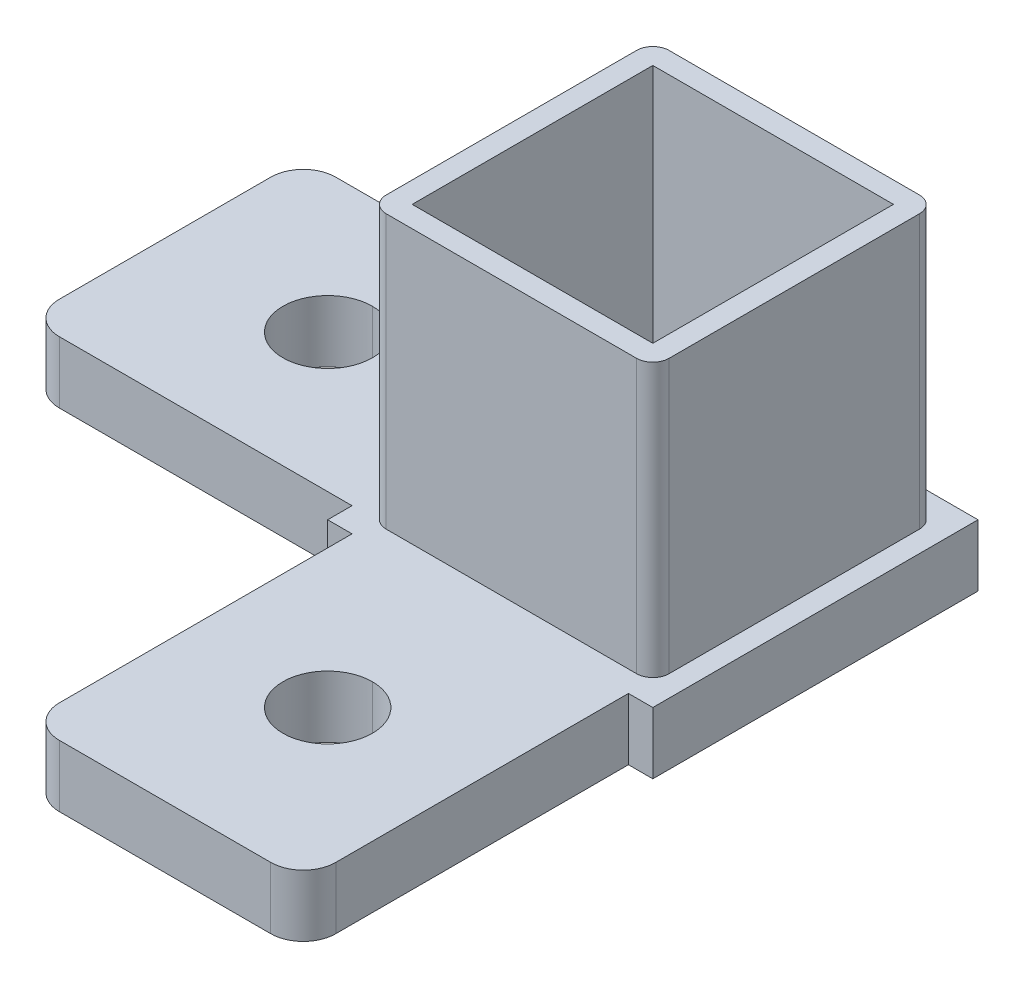
ISO-10303-21;
HEADER;
FILE_DESCRIPTION(('STEP AP214'),'2;1');
FILE_NAME('part.step','',(''),(''),'','','');
FILE_SCHEMA(('AUTOMOTIVE_DESIGN { 1 0 10303 214 1 1 1 1 }'));
ENDSEC;
DATA;
#1=APPLICATION_CONTEXT('core data for automotive mechanical design processes');
#2=APPLICATION_PROTOCOL_DEFINITION('international standard','automotive_design',2000,#1);
#3=PRODUCT_CONTEXT('',#1,'mechanical');
#4=PRODUCT('Part','Part','',(#3));
#5=PRODUCT_RELATED_PRODUCT_CATEGORY('part','',(#4));
#6=PRODUCT_DEFINITION_FORMATION('','',#4);
#7=PRODUCT_DEFINITION_CONTEXT('part definition',#1,'design');
#8=PRODUCT_DEFINITION('design','',#6,#7);
#9=PRODUCT_DEFINITION_SHAPE('','',#8);
#10=(LENGTH_UNIT() NAMED_UNIT(*) SI_UNIT(.MILLI.,.METRE.));
#11=(NAMED_UNIT(*) PLANE_ANGLE_UNIT() SI_UNIT($,.RADIAN.));
#12=(NAMED_UNIT(*) SI_UNIT($,.STERADIAN.) SOLID_ANGLE_UNIT());
#13=UNCERTAINTY_MEASURE_WITH_UNIT(LENGTH_MEASURE(1.E-05),#10,'distance_accuracy_value','');
#14=(GEOMETRIC_REPRESENTATION_CONTEXT(3) GLOBAL_UNCERTAINTY_ASSIGNED_CONTEXT((#13)) GLOBAL_UNIT_ASSIGNED_CONTEXT((#10,
#11,#12)) REPRESENTATION_CONTEXT('',''));
#15=CARTESIAN_POINT('',(0.,0.,0.));
#16=DIRECTION('',(0.,0.,1.));
#17=DIRECTION('',(1.,0.,0.));
#18=AXIS2_PLACEMENT_3D('',#15,#16,#17);
#19=CARTESIAN_POINT('',(-38.1,4.826,-8.255));
#20=DIRECTION('',(1.,0.,0.));
#21=DIRECTION('',(0.,0.,-1.));
#22=AXIS2_PLACEMENT_3D('',#19,#20,#21);
#23=PLANE('',#22);
#24=DIRECTION('',(0.,0.,1.));
#25=VECTOR('',#24,1.);
#26=CARTESIAN_POINT('',(-38.1,0.,-8.255));
#27=LINE('',#26,#25);
#28=CARTESIAN_POINT('',(-38.1,0.,-8.255));
#29=VERTEX_POINT('',#28);
#30=CARTESIAN_POINT('',(-38.1,0.,8.255));
#31=VERTEX_POINT('',#30);
#32=EDGE_CURVE('E11',#29,#31,#27,.T.);
#33=ORIENTED_EDGE('',*,*,#32,.T.);
#34=DIRECTION('',(0.,-1.,0.));
#35=VECTOR('',#34,1.);
#36=CARTESIAN_POINT('',(-38.1,4.826,8.255));
#37=LINE('',#36,#35);
#38=CARTESIAN_POINT('',(-38.1,4.826,8.255));
#39=VERTEX_POINT('',#38);
#40=EDGE_CURVE('E25',#39,#31,#37,.T.);
#41=ORIENTED_EDGE('',*,*,#40,.F.);
#42=DIRECTION('',(0.,0.,1.));
#43=VECTOR('',#42,1.);
#44=CARTESIAN_POINT('',(-38.1,4.826,-8.255));
#45=LINE('',#44,#43);
#46=CARTESIAN_POINT('',(-38.1,4.826,-8.255));
#47=VERTEX_POINT('',#46);
#48=EDGE_CURVE('E666',#47,#39,#45,.T.);
#49=ORIENTED_EDGE('',*,*,#48,.F.);
#50=DIRECTION('',(0.,-1.,0.));
#51=VECTOR('',#50,1.);
#52=CARTESIAN_POINT('',(-38.1,4.826,-8.255));
#53=LINE('',#52,#51);
#54=EDGE_CURVE('E662',#47,#29,#53,.T.);
#55=ORIENTED_EDGE('',*,*,#54,.T.);
#56=EDGE_LOOP('',(#33,#41,#49,#55));
#57=FACE_BOUND('',#56,.T.);
#58=ADVANCED_FACE('F17',(#57),#23,.F.);
#59=CARTESIAN_POINT('',(-35.5600000000018,4.826,-8.25500000000177));
#60=DIRECTION('',(0.,-1.,0.));
#61=DIRECTION('',(0.707106781186551,0.,0.707106781186544));
#62=AXIS2_PLACEMENT_3D('',#59,#60,#61);
#63=CYLINDRICAL_SURFACE('',#62,2.53999999999824);
#64=CARTESIAN_POINT('',(-35.5600000000018,0.,-8.25500000000177));
#65=DIRECTION('',(0.,1.,0.));
#66=DIRECTION('',(1.,0.,0.));
#67=AXIS2_PLACEMENT_3D('',#64,#65,#66);
#68=CIRCLE('',#67,2.53999999999824);
#69=CARTESIAN_POINT('',(-35.56,0.,-10.795));
#70=VERTEX_POINT('',#69);
#71=EDGE_CURVE('E657',#70,#29,#68,.T.);
#72=ORIENTED_EDGE('',*,*,#71,.T.);
#73=ORIENTED_EDGE('',*,*,#54,.F.);
#74=CARTESIAN_POINT('',(-35.5600000000018,4.826,-8.25500000000177));
#75=DIRECTION('',(0.,1.,0.));
#76=DIRECTION('',(1.,0.,0.));
#77=AXIS2_PLACEMENT_3D('',#74,#75,#76);
#78=CIRCLE('',#77,2.53999999999824);
#79=CARTESIAN_POINT('',(-35.56,4.826,-10.795));
#80=VERTEX_POINT('',#79);
#81=EDGE_CURVE('E652',#80,#47,#78,.T.);
#82=ORIENTED_EDGE('',*,*,#81,.F.);
#83=DIRECTION('',(0.,-1.,0.));
#84=VECTOR('',#83,1.);
#85=CARTESIAN_POINT('',(-35.56,4.826,-10.795));
#86=LINE('',#85,#84);
#87=EDGE_CURVE('E648',#80,#70,#86,.T.);
#88=ORIENTED_EDGE('',*,*,#87,.T.);
#89=EDGE_LOOP('',(#72,#73,#82,#88));
#90=FACE_BOUND('',#89,.T.);
#91=ADVANCED_FACE('F684',(#90),#63,.T.);
#92=CARTESIAN_POINT('',(-12.7,4.826,-10.795));
#93=DIRECTION('',(0.,0.,1.));
#94=DIRECTION('',(1.,0.,0.));
#95=AXIS2_PLACEMENT_3D('',#92,#93,#94);
#96=PLANE('',#95);
#97=DIRECTION('',(-1.,0.,0.));
#98=VECTOR('',#97,1.);
#99=CARTESIAN_POINT('',(-12.7,0.,-10.795));
#100=LINE('',#99,#98);
#101=CARTESIAN_POINT('',(-12.7,0.,-10.795));
#102=VERTEX_POINT('',#101);
#103=EDGE_CURVE('E643',#102,#70,#100,.T.);
#104=ORIENTED_EDGE('',*,*,#103,.T.);
#105=ORIENTED_EDGE('',*,*,#87,.F.);
#106=DIRECTION('',(-1.,0.,0.));
#107=VECTOR('',#106,1.);
#108=CARTESIAN_POINT('',(-12.7,4.826,-10.795));
#109=LINE('',#108,#107);
#110=CARTESIAN_POINT('',(-12.7,4.826,-10.795));
#111=VERTEX_POINT('',#110);
#112=EDGE_CURVE('E638',#111,#80,#109,.T.);
#113=ORIENTED_EDGE('',*,*,#112,.F.);
#114=DIRECTION('',(0.,-1.,0.));
#115=VECTOR('',#114,1.);
#116=CARTESIAN_POINT('',(-12.7,4.826,-10.795));
#117=LINE('',#116,#115);
#118=EDGE_CURVE('E634',#111,#102,#117,.T.);
#119=ORIENTED_EDGE('',*,*,#118,.T.);
#120=EDGE_LOOP('',(#104,#105,#113,#119));
#121=FACE_BOUND('',#120,.T.);
#122=ADVANCED_FACE('F737',(#121),#96,.F.);
#123=CARTESIAN_POINT('',(-12.7,4.826,-12.7));
#124=DIRECTION('',(1.,0.,0.));
#125=DIRECTION('',(0.,0.,-1.));
#126=AXIS2_PLACEMENT_3D('',#123,#124,#125);
#127=PLANE('',#126);
#128=DIRECTION('',(0.,0.,1.));
#129=VECTOR('',#128,1.);
#130=CARTESIAN_POINT('',(-12.7,0.,-12.7));
#131=LINE('',#130,#129);
#132=CARTESIAN_POINT('',(-12.7,0.,-12.7));
#133=VERTEX_POINT('',#132);
#134=EDGE_CURVE('E629',#133,#102,#131,.T.);
#135=ORIENTED_EDGE('',*,*,#134,.T.);
#136=ORIENTED_EDGE('',*,*,#118,.F.);
#137=DIRECTION('',(0.,0.,1.));
#138=VECTOR('',#137,1.);
#139=CARTESIAN_POINT('',(-12.7,4.826,-12.7));
#140=LINE('',#139,#138);
#141=CARTESIAN_POINT('',(-12.7,4.826,-12.7));
#142=VERTEX_POINT('',#141);
#143=EDGE_CURVE('E624',#142,#111,#140,.T.);
#144=ORIENTED_EDGE('',*,*,#143,.F.);
#145=DIRECTION('',(0.,-1.,0.));
#146=VECTOR('',#145,1.);
#147=CARTESIAN_POINT('',(-12.7,4.826,-12.7));
#148=LINE('',#147,#146);
#149=EDGE_CURVE('E620',#142,#133,#148,.T.);
#150=ORIENTED_EDGE('',*,*,#149,.T.);
#151=EDGE_LOOP('',(#135,#136,#144,#150));
#152=FACE_BOUND('',#151,.T.);
#153=ADVANCED_FACE('F734',(#152),#127,.F.);
#154=CARTESIAN_POINT('',(12.7,4.826,-12.7));
#155=DIRECTION('',(0.,0.,1.));
#156=DIRECTION('',(1.,0.,0.));
#157=AXIS2_PLACEMENT_3D('',#154,#155,#156);
#158=PLANE('',#157);
#159=DIRECTION('',(-1.,0.,0.));
#160=VECTOR('',#159,1.);
#161=CARTESIAN_POINT('',(12.7,0.,-12.7));
#162=LINE('',#161,#160);
#163=CARTESIAN_POINT('',(12.7,0.,-12.7));
#164=VERTEX_POINT('',#163);
#165=EDGE_CURVE('E615',#164,#133,#162,.T.);
#166=ORIENTED_EDGE('',*,*,#165,.T.);
#167=ORIENTED_EDGE('',*,*,#149,.F.);
#168=DIRECTION('',(-1.,0.,0.));
#169=VECTOR('',#168,1.);
#170=CARTESIAN_POINT('',(12.7,4.826,-12.7));
#171=LINE('',#170,#169);
#172=CARTESIAN_POINT('',(12.7,4.826,-12.7));
#173=VERTEX_POINT('',#172);
#174=EDGE_CURVE('E610',#173,#142,#171,.T.);
#175=ORIENTED_EDGE('',*,*,#174,.F.);
#176=DIRECTION('',(0.,-1.,0.));
#177=VECTOR('',#176,1.);
#178=CARTESIAN_POINT('',(12.7,4.826,-12.7));
#179=LINE('',#178,#177);
#180=EDGE_CURVE('E606',#173,#164,#179,.T.);
#181=ORIENTED_EDGE('',*,*,#180,.T.);
#182=EDGE_LOOP('',(#166,#167,#175,#181));
#183=FACE_BOUND('',#182,.T.);
#184=ADVANCED_FACE('F731',(#183),#158,.F.);
#185=CARTESIAN_POINT('',(12.7,4.826,12.7));
#186=DIRECTION('',(-1.,0.,0.));
#187=DIRECTION('',(0.,0.,1.));
#188=AXIS2_PLACEMENT_3D('',#185,#186,#187);
#189=PLANE('',#188);
#190=DIRECTION('',(0.,0.,-1.));
#191=VECTOR('',#190,1.);
#192=CARTESIAN_POINT('',(12.7,0.,12.7));
#193=LINE('',#192,#191);
#194=CARTESIAN_POINT('',(12.7,0.,12.7));
#195=VERTEX_POINT('',#194);
#196=EDGE_CURVE('E601',#195,#164,#193,.T.);
#197=ORIENTED_EDGE('',*,*,#196,.T.);
#198=ORIENTED_EDGE('',*,*,#180,.F.);
#199=DIRECTION('',(0.,0.,-1.));
#200=VECTOR('',#199,1.);
#201=CARTESIAN_POINT('',(12.7,4.826,12.7));
#202=LINE('',#201,#200);
#203=CARTESIAN_POINT('',(12.7,4.826,12.7));
#204=VERTEX_POINT('',#203);
#205=EDGE_CURVE('E596',#204,#173,#202,.T.);
#206=ORIENTED_EDGE('',*,*,#205,.F.);
#207=DIRECTION('',(0.,-1.,0.));
#208=VECTOR('',#207,1.);
#209=CARTESIAN_POINT('',(12.7,4.826,12.7));
#210=LINE('',#209,#208);
#211=EDGE_CURVE('E592',#204,#195,#210,.T.);
#212=ORIENTED_EDGE('',*,*,#211,.T.);
#213=EDGE_LOOP('',(#197,#198,#206,#212));
#214=FACE_BOUND('',#213,.T.);
#215=ADVANCED_FACE('F726',(#214),#189,.F.);
#216=CARTESIAN_POINT('',(10.795,4.826,12.7));
#217=DIRECTION('',(0.,0.,-1.));
#218=DIRECTION('',(-1.,0.,0.));
#219=AXIS2_PLACEMENT_3D('',#216,#217,#218);
#220=PLANE('',#219);
#221=DIRECTION('',(1.,0.,0.));
#222=VECTOR('',#221,1.);
#223=CARTESIAN_POINT('',(10.795,0.,12.7));
#224=LINE('',#223,#222);
#225=CARTESIAN_POINT('',(10.795,0.,12.7));
#226=VERTEX_POINT('',#225);
#227=EDGE_CURVE('E587',#226,#195,#224,.T.);
#228=ORIENTED_EDGE('',*,*,#227,.T.);
#229=ORIENTED_EDGE('',*,*,#211,.F.);
#230=DIRECTION('',(1.,0.,0.));
#231=VECTOR('',#230,1.);
#232=CARTESIAN_POINT('',(10.795,4.826,12.7));
#233=LINE('',#232,#231);
#234=CARTESIAN_POINT('',(10.795,4.826,12.7));
#235=VERTEX_POINT('',#234);
#236=EDGE_CURVE('E582',#235,#204,#233,.T.);
#237=ORIENTED_EDGE('',*,*,#236,.F.);
#238=DIRECTION('',(0.,-1.,0.));
#239=VECTOR('',#238,1.);
#240=CARTESIAN_POINT('',(10.795,4.826,12.7));
#241=LINE('',#240,#239);
#242=EDGE_CURVE('E578',#235,#226,#241,.T.);
#243=ORIENTED_EDGE('',*,*,#242,.T.);
#244=EDGE_LOOP('',(#228,#229,#237,#243));
#245=FACE_BOUND('',#244,.T.);
#246=ADVANCED_FACE('F723',(#245),#220,.F.);
#247=CARTESIAN_POINT('',(10.795,4.826,35.56));
#248=DIRECTION('',(-1.,0.,0.));
#249=DIRECTION('',(0.,0.,1.));
#250=AXIS2_PLACEMENT_3D('',#247,#248,#249);
#251=PLANE('',#250);
#252=DIRECTION('',(0.,0.,-1.));
#253=VECTOR('',#252,1.);
#254=CARTESIAN_POINT('',(10.795,0.,35.56));
#255=LINE('',#254,#253);
#256=CARTESIAN_POINT('',(10.795,0.,35.56));
#257=VERTEX_POINT('',#256);
#258=EDGE_CURVE('E573',#257,#226,#255,.T.);
#259=ORIENTED_EDGE('',*,*,#258,.T.);
#260=ORIENTED_EDGE('',*,*,#242,.F.);
#261=DIRECTION('',(0.,0.,-1.));
#262=VECTOR('',#261,1.);
#263=CARTESIAN_POINT('',(10.795,4.826,35.56));
#264=LINE('',#263,#262);
#265=CARTESIAN_POINT('',(10.795,4.826,35.56));
#266=VERTEX_POINT('',#265);
#267=EDGE_CURVE('E568',#266,#235,#264,.T.);
#268=ORIENTED_EDGE('',*,*,#267,.F.);
#269=DIRECTION('',(0.,-1.,0.));
#270=VECTOR('',#269,1.);
#271=CARTESIAN_POINT('',(10.795,4.826,35.56));
#272=LINE('',#271,#270);
#273=EDGE_CURVE('E564',#266,#257,#272,.T.);
#274=ORIENTED_EDGE('',*,*,#273,.T.);
#275=EDGE_LOOP('',(#259,#260,#268,#274));
#276=FACE_BOUND('',#275,.T.);
#277=ADVANCED_FACE('F720',(#276),#251,.F.);
#278=CARTESIAN_POINT('',(8.25500000000177,4.826,35.5600000000018));
#279=DIRECTION('',(0.,-1.,0.));
#280=DIRECTION('',(-0.707106781186545,0.,-0.70710678118655));
#281=AXIS2_PLACEMENT_3D('',#278,#279,#280);
#282=CYLINDRICAL_SURFACE('',#281,2.53999999999823);
#283=CARTESIAN_POINT('',(8.25500000000177,0.,35.5600000000018));
#284=DIRECTION('',(0.,1.,0.));
#285=DIRECTION('',(1.,0.,0.));
#286=AXIS2_PLACEMENT_3D('',#283,#284,#285);
#287=CIRCLE('',#286,2.53999999999823);
#288=CARTESIAN_POINT('',(8.255,0.,38.1));
#289=VERTEX_POINT('',#288);
#290=EDGE_CURVE('E559',#289,#257,#287,.T.);
#291=ORIENTED_EDGE('',*,*,#290,.T.);
#292=ORIENTED_EDGE('',*,*,#273,.F.);
#293=CARTESIAN_POINT('',(8.25500000000177,4.826,35.5600000000018));
#294=DIRECTION('',(0.,1.,0.));
#295=DIRECTION('',(1.,0.,0.));
#296=AXIS2_PLACEMENT_3D('',#293,#294,#295);
#297=CIRCLE('',#296,2.53999999999823);
#298=CARTESIAN_POINT('',(8.255,4.826,38.1));
#299=VERTEX_POINT('',#298);
#300=EDGE_CURVE('E554',#299,#266,#297,.T.);
#301=ORIENTED_EDGE('',*,*,#300,.F.);
#302=DIRECTION('',(0.,-1.,0.));
#303=VECTOR('',#302,1.);
#304=CARTESIAN_POINT('',(8.255,4.826,38.1));
#305=LINE('',#304,#303);
#306=EDGE_CURVE('E550',#299,#289,#305,.T.);
#307=ORIENTED_EDGE('',*,*,#306,.T.);
#308=EDGE_LOOP('',(#291,#292,#301,#307));
#309=FACE_BOUND('',#308,.T.);
#310=ADVANCED_FACE('F714',(#309),#282,.T.);
#311=CARTESIAN_POINT('',(-8.255,4.826,38.1));
#312=DIRECTION('',(0.,0.,-1.));
#313=DIRECTION('',(-1.,0.,0.));
#314=AXIS2_PLACEMENT_3D('',#311,#312,#313);
#315=PLANE('',#314);
#316=DIRECTION('',(1.,0.,0.));
#317=VECTOR('',#316,1.);
#318=CARTESIAN_POINT('',(-8.255,0.,38.1));
#319=LINE('',#318,#317);
#320=CARTESIAN_POINT('',(-8.255,0.,38.1));
#321=VERTEX_POINT('',#320);
#322=EDGE_CURVE('E545',#321,#289,#319,.T.);
#323=ORIENTED_EDGE('',*,*,#322,.T.);
#324=ORIENTED_EDGE('',*,*,#306,.F.);
#325=DIRECTION('',(1.,0.,0.));
#326=VECTOR('',#325,1.);
#327=CARTESIAN_POINT('',(-8.255,4.826,38.1));
#328=LINE('',#327,#326);
#329=CARTESIAN_POINT('',(-8.255,4.826,38.1));
#330=VERTEX_POINT('',#329);
#331=EDGE_CURVE('E540',#330,#299,#328,.T.);
#332=ORIENTED_EDGE('',*,*,#331,.F.);
#333=DIRECTION('',(0.,-1.,0.));
#334=VECTOR('',#333,1.);
#335=CARTESIAN_POINT('',(-8.255,4.826,38.1));
#336=LINE('',#335,#334);
#337=EDGE_CURVE('E536',#330,#321,#336,.T.);
#338=ORIENTED_EDGE('',*,*,#337,.T.);
#339=EDGE_LOOP('',(#323,#324,#332,#338));
#340=FACE_BOUND('',#339,.T.);
#341=ADVANCED_FACE('F710',(#340),#315,.F.);
#342=CARTESIAN_POINT('',(-8.25500000000177,4.826,35.5600000000018));
#343=DIRECTION('',(0.,-1.,0.));
#344=DIRECTION('',(0.707106781186545,0.,-0.70710678118655));
#345=AXIS2_PLACEMENT_3D('',#342,#343,#344);
#346=CYLINDRICAL_SURFACE('',#345,2.53999999999824);
#347=CARTESIAN_POINT('',(-8.25500000000177,0.,35.5600000000018));
#348=DIRECTION('',(0.,1.,0.));
#349=DIRECTION('',(1.,0.,0.));
#350=AXIS2_PLACEMENT_3D('',#347,#348,#349);
#351=CIRCLE('',#350,2.53999999999824);
#352=CARTESIAN_POINT('',(-10.795,0.,35.56));
#353=VERTEX_POINT('',#352);
#354=EDGE_CURVE('E531',#353,#321,#351,.T.);
#355=ORIENTED_EDGE('',*,*,#354,.T.);
#356=ORIENTED_EDGE('',*,*,#337,.F.);
#357=CARTESIAN_POINT('',(-8.25500000000177,4.826,35.5600000000018));
#358=DIRECTION('',(0.,1.,0.));
#359=DIRECTION('',(1.,0.,0.));
#360=AXIS2_PLACEMENT_3D('',#357,#358,#359);
#361=CIRCLE('',#360,2.53999999999824);
#362=CARTESIAN_POINT('',(-10.795,4.826,35.56));
#363=VERTEX_POINT('',#362);
#364=EDGE_CURVE('E526',#363,#330,#361,.T.);
#365=ORIENTED_EDGE('',*,*,#364,.F.);
#366=DIRECTION('',(0.,-1.,0.));
#367=VECTOR('',#366,1.);
#368=CARTESIAN_POINT('',(-10.795,4.826,35.56));
#369=LINE('',#368,#367);
#370=EDGE_CURVE('E522',#363,#353,#369,.T.);
#371=ORIENTED_EDGE('',*,*,#370,.T.);
#372=EDGE_LOOP('',(#355,#356,#365,#371));
#373=FACE_BOUND('',#372,.T.);
#374=ADVANCED_FACE('F707',(#373),#346,.T.);
#375=CARTESIAN_POINT('',(-10.795,4.826,12.7));
#376=DIRECTION('',(1.,0.,0.));
#377=DIRECTION('',(0.,0.,-1.));
#378=AXIS2_PLACEMENT_3D('',#375,#376,#377);
#379=PLANE('',#378);
#380=DIRECTION('',(0.,0.,1.));
#381=VECTOR('',#380,1.);
#382=CARTESIAN_POINT('',(-10.795,0.,12.7));
#383=LINE('',#382,#381);
#384=CARTESIAN_POINT('',(-10.795,0.,12.7));
#385=VERTEX_POINT('',#384);
#386=EDGE_CURVE('E517',#385,#353,#383,.T.);
#387=ORIENTED_EDGE('',*,*,#386,.T.);
#388=ORIENTED_EDGE('',*,*,#370,.F.);
#389=DIRECTION('',(0.,0.,1.));
#390=VECTOR('',#389,1.);
#391=CARTESIAN_POINT('',(-10.795,4.826,12.7));
#392=LINE('',#391,#390);
#393=CARTESIAN_POINT('',(-10.795,4.826,12.7));
#394=VERTEX_POINT('',#393);
#395=EDGE_CURVE('E512',#394,#363,#392,.T.);
#396=ORIENTED_EDGE('',*,*,#395,.F.);
#397=DIRECTION('',(0.,-1.,0.));
#398=VECTOR('',#397,1.);
#399=CARTESIAN_POINT('',(-10.795,4.826,12.7));
#400=LINE('',#399,#398);
#401=EDGE_CURVE('E508',#394,#385,#400,.T.);
#402=ORIENTED_EDGE('',*,*,#401,.T.);
#403=EDGE_LOOP('',(#387,#388,#396,#402));
#404=FACE_BOUND('',#403,.T.);
#405=ADVANCED_FACE('F702',(#404),#379,.F.);
#406=CARTESIAN_POINT('',(-12.7,4.826,12.7));
#407=DIRECTION('',(0.,0.,-1.));
#408=DIRECTION('',(-1.,0.,0.));
#409=AXIS2_PLACEMENT_3D('',#406,#407,#408);
#410=PLANE('',#409);
#411=DIRECTION('',(1.,0.,0.));
#412=VECTOR('',#411,1.);
#413=CARTESIAN_POINT('',(-12.7,0.,12.7));
#414=LINE('',#413,#412);
#415=CARTESIAN_POINT('',(-12.7,0.,12.7));
#416=VERTEX_POINT('',#415);
#417=EDGE_CURVE('E503',#416,#385,#414,.T.);
#418=ORIENTED_EDGE('',*,*,#417,.T.);
#419=ORIENTED_EDGE('',*,*,#401,.F.);
#420=DIRECTION('',(1.,0.,0.));
#421=VECTOR('',#420,1.);
#422=CARTESIAN_POINT('',(-12.7,4.826,12.7));
#423=LINE('',#422,#421);
#424=CARTESIAN_POINT('',(-12.7,4.826,12.7));
#425=VERTEX_POINT('',#424);
#426=EDGE_CURVE('E498',#425,#394,#423,.T.);
#427=ORIENTED_EDGE('',*,*,#426,.F.);
#428=DIRECTION('',(0.,-1.,0.));
#429=VECTOR('',#428,1.);
#430=CARTESIAN_POINT('',(-12.7,4.826,12.7));
#431=LINE('',#430,#429);
#432=EDGE_CURVE('E494',#425,#416,#431,.T.);
#433=ORIENTED_EDGE('',*,*,#432,.T.);
#434=EDGE_LOOP('',(#418,#419,#427,#433));
#435=FACE_BOUND('',#434,.T.);
#436=ADVANCED_FACE('F698',(#435),#410,.F.);
#437=CARTESIAN_POINT('',(-12.7,4.826,10.795));
#438=DIRECTION('',(1.,0.,0.));
#439=DIRECTION('',(0.,0.,-1.));
#440=AXIS2_PLACEMENT_3D('',#437,#438,#439);
#441=PLANE('',#440);
#442=DIRECTION('',(0.,0.,1.));
#443=VECTOR('',#442,1.);
#444=CARTESIAN_POINT('',(-12.7,0.,10.795));
#445=LINE('',#444,#443);
#446=CARTESIAN_POINT('',(-12.7,0.,10.795));
#447=VERTEX_POINT('',#446);
#448=EDGE_CURVE('E489',#447,#416,#445,.T.);
#449=ORIENTED_EDGE('',*,*,#448,.T.);
#450=ORIENTED_EDGE('',*,*,#432,.F.);
#451=DIRECTION('',(0.,0.,1.));
#452=VECTOR('',#451,1.);
#453=CARTESIAN_POINT('',(-12.7,4.826,10.795));
#454=LINE('',#453,#452);
#455=CARTESIAN_POINT('',(-12.7,4.826,10.795));
#456=VERTEX_POINT('',#455);
#457=EDGE_CURVE('E484',#456,#425,#454,.T.);
#458=ORIENTED_EDGE('',*,*,#457,.F.);
#459=DIRECTION('',(0.,-1.,0.));
#460=VECTOR('',#459,1.);
#461=CARTESIAN_POINT('',(-12.7,4.826,10.795));
#462=LINE('',#461,#460);
#463=EDGE_CURVE('E480',#456,#447,#462,.T.);
#464=ORIENTED_EDGE('',*,*,#463,.T.);
#465=EDGE_LOOP('',(#449,#450,#458,#464));
#466=FACE_BOUND('',#465,.T.);
#467=ADVANCED_FACE('F696',(#466),#441,.F.);
#468=CARTESIAN_POINT('',(-35.56,4.826,10.795));
#469=DIRECTION('',(0.,0.,-1.));
#470=DIRECTION('',(-1.,0.,0.));
#471=AXIS2_PLACEMENT_3D('',#468,#469,#470);
#472=PLANE('',#471);
#473=DIRECTION('',(1.,0.,0.));
#474=VECTOR('',#473,1.);
#475=CARTESIAN_POINT('',(-35.56,0.,10.795));
#476=LINE('',#475,#474);
#477=CARTESIAN_POINT('',(-35.56,0.,10.795));
#478=VERTEX_POINT('',#477);
#479=EDGE_CURVE('E475',#478,#447,#476,.T.);
#480=ORIENTED_EDGE('',*,*,#479,.T.);
#481=ORIENTED_EDGE('',*,*,#463,.F.);
#482=DIRECTION('',(1.,0.,0.));
#483=VECTOR('',#482,1.);
#484=CARTESIAN_POINT('',(-35.56,4.826,10.795));
#485=LINE('',#484,#483);
#486=CARTESIAN_POINT('',(-35.56,4.826,10.795));
#487=VERTEX_POINT('',#486);
#488=EDGE_CURVE('E470',#487,#456,#485,.T.);
#489=ORIENTED_EDGE('',*,*,#488,.F.);
#490=DIRECTION('',(0.,-1.,0.));
#491=VECTOR('',#490,1.);
#492=CARTESIAN_POINT('',(-35.56,4.826,10.795));
#493=LINE('',#492,#491);
#494=EDGE_CURVE('E466',#487,#478,#493,.T.);
#495=ORIENTED_EDGE('',*,*,#494,.T.);
#496=EDGE_LOOP('',(#480,#481,#489,#495));
#497=FACE_BOUND('',#496,.T.);
#498=ADVANCED_FACE('F693',(#497),#472,.F.);
#499=CARTESIAN_POINT('',(-35.5600000000018,4.826,8.25500000000177));
#500=DIRECTION('',(0.,-1.,0.));
#501=DIRECTION('',(0.707106781186551,0.,-0.707106781186544));
#502=AXIS2_PLACEMENT_3D('',#499,#500,#501);
#503=CYLINDRICAL_SURFACE('',#502,2.53999999999823);
#504=CARTESIAN_POINT('',(-35.5600000000018,0.,8.25500000000177));
#505=DIRECTION('',(0.,1.,0.));
#506=DIRECTION('',(1.,0.,0.));
#507=AXIS2_PLACEMENT_3D('',#504,#505,#506);
#508=CIRCLE('',#507,2.53999999999823);
#509=EDGE_CURVE('E461',#31,#478,#508,.T.);
#510=ORIENTED_EDGE('',*,*,#509,.T.);
#511=ORIENTED_EDGE('',*,*,#494,.F.);
#512=CARTESIAN_POINT('',(-35.5600000000018,4.826,8.25500000000177));
#513=DIRECTION('',(0.,1.,0.));
#514=DIRECTION('',(1.,0.,0.));
#515=AXIS2_PLACEMENT_3D('',#512,#513,#514);
#516=CIRCLE('',#515,2.53999999999823);
#517=EDGE_CURVE('E456',#39,#487,#516,.T.);
#518=ORIENTED_EDGE('',*,*,#517,.F.);
#519=ORIENTED_EDGE('',*,*,#40,.T.);
#520=EDGE_LOOP('',(#510,#511,#518,#519));
#521=FACE_BOUND('',#520,.T.);
#522=ADVANCED_FACE('F676',(#521),#503,.T.);
#523=CARTESIAN_POINT('',(-35.5600000000018,4.826,8.25500000000177));
#524=DIRECTION('',(0.,1.,0.));
#525=DIRECTION('',(0.,0.,1.));
#526=AXIS2_PLACEMENT_3D('',#523,#524,#525);
#527=PLANE('',#526);
#528=CARTESIAN_POINT('',(-9.77900000000023,4.826,9.77900000000023));
#529=DIRECTION('',(0.,-1.,0.));
#530=DIRECTION('',(0.,0.,1.));
#531=AXIS2_PLACEMENT_3D('',#528,#529,#530);
#532=CIRCLE('',#531,1.26999999999977);
#533=CARTESIAN_POINT('',(-9.779,4.826,11.049));
#534=VERTEX_POINT('',#533);
#535=CARTESIAN_POINT('',(-11.049,4.826,9.779));
#536=VERTEX_POINT('',#535);
#537=EDGE_CURVE('E452',#534,#536,#532,.T.);
#538=ORIENTED_EDGE('',*,*,#537,.T.);
#539=DIRECTION('',(0.,0.,-1.));
#540=VECTOR('',#539,1.);
#541=CARTESIAN_POINT('',(-11.049,4.826,8.25500000000177));
#542=LINE('',#541,#540);
#543=CARTESIAN_POINT('',(-11.049,4.826,-9.779));
#544=VERTEX_POINT('',#543);
#545=EDGE_CURVE('E448',#536,#544,#542,.T.);
#546=ORIENTED_EDGE('',*,*,#545,.T.);
#547=CARTESIAN_POINT('',(-9.77900000000023,4.826,-9.77900000000023));
#548=DIRECTION('',(0.,-1.,0.));
#549=DIRECTION('',(0.,0.,1.));
#550=AXIS2_PLACEMENT_3D('',#547,#548,#549);
#551=CIRCLE('',#550,1.26999999999977);
#552=CARTESIAN_POINT('',(-9.779,4.826,-11.049));
#553=VERTEX_POINT('',#552);
#554=EDGE_CURVE('E444',#544,#553,#551,.T.);
#555=ORIENTED_EDGE('',*,*,#554,.T.);
#556=DIRECTION('',(1.,0.,0.));
#557=VECTOR('',#556,1.);
#558=CARTESIAN_POINT('',(-35.5600000000018,4.826,-11.049));
#559=LINE('',#558,#557);
#560=CARTESIAN_POINT('',(9.779,4.826,-11.049));
#561=VERTEX_POINT('',#560);
#562=EDGE_CURVE('E440',#553,#561,#559,.T.);
#563=ORIENTED_EDGE('',*,*,#562,.T.);
#564=CARTESIAN_POINT('',(9.77900000000023,4.826,-9.77900000000023));
#565=DIRECTION('',(0.,-1.,0.));
#566=DIRECTION('',(0.,0.,1.));
#567=AXIS2_PLACEMENT_3D('',#564,#565,#566);
#568=CIRCLE('',#567,1.26999999999977);
#569=CARTESIAN_POINT('',(11.049,4.826,-9.779));
#570=VERTEX_POINT('',#569);
#571=EDGE_CURVE('E436',#561,#570,#568,.T.);
#572=ORIENTED_EDGE('',*,*,#571,.T.);
#573=DIRECTION('',(0.,0.,1.));
#574=VECTOR('',#573,1.);
#575=CARTESIAN_POINT('',(11.049,4.826,8.25500000000177));
#576=LINE('',#575,#574);
#577=CARTESIAN_POINT('',(11.049,4.826,9.779));
#578=VERTEX_POINT('',#577);
#579=EDGE_CURVE('E432',#570,#578,#576,.T.);
#580=ORIENTED_EDGE('',*,*,#579,.T.);
#581=CARTESIAN_POINT('',(9.77900000000023,4.826,9.77900000000023));
#582=DIRECTION('',(0.,-1.,0.));
#583=DIRECTION('',(0.,0.,1.));
#584=AXIS2_PLACEMENT_3D('',#581,#582,#583);
#585=CIRCLE('',#584,1.26999999999977);
#586=CARTESIAN_POINT('',(9.779,4.826,11.049));
#587=VERTEX_POINT('',#586);
#588=EDGE_CURVE('E428',#578,#587,#585,.T.);
#589=ORIENTED_EDGE('',*,*,#588,.T.);
#590=DIRECTION('',(-1.,0.,0.));
#591=VECTOR('',#590,1.);
#592=CARTESIAN_POINT('',(-35.5600000000018,4.826,11.049));
#593=LINE('',#592,#591);
#594=EDGE_CURVE('E424',#587,#534,#593,.T.);
#595=ORIENTED_EDGE('',*,*,#594,.T.);
#596=EDGE_LOOP('',(#538,#546,#555,#563,#572,#580,#589,#595));
#597=FACE_BOUND('',#596,.T.);
#598=CARTESIAN_POINT('',(-25.4,4.826,0.));
#599=DIRECTION('',(0.,1.,0.));
#600=DIRECTION('',(0.,0.,1.));
#601=AXIS2_PLACEMENT_3D('',#598,#599,#600);
#602=CIRCLE('',#601,3.4925);
#603=CARTESIAN_POINT('',(-25.4,4.826,3.4925));
#604=VERTEX_POINT('',#603);
#605=CARTESIAN_POINT('',(-25.4,4.826,-3.4925));
#606=VERTEX_POINT('',#605);
#607=EDGE_CURVE('E419',#604,#606,#602,.T.);
#608=ORIENTED_EDGE('',*,*,#607,.F.);
#609=CARTESIAN_POINT('',(-25.4,4.826,0.));
#610=DIRECTION('',(0.,1.,0.));
#611=DIRECTION('',(1.,0.,0.));
#612=AXIS2_PLACEMENT_3D('',#609,#610,#611);
#613=CIRCLE('',#612,3.4925);
#614=EDGE_CURVE('E414',#606,#604,#613,.T.);
#615=ORIENTED_EDGE('',*,*,#614,.F.);
#616=EDGE_LOOP('',(#608,#615));
#617=FACE_BOUND('',#616,.T.);
#618=CARTESIAN_POINT('',(0.,4.826,25.4));
#619=DIRECTION('',(0.,1.,0.));
#620=DIRECTION('',(0.,0.,1.));
#621=AXIS2_PLACEMENT_3D('',#618,#619,#620);
#622=CIRCLE('',#621,3.4925);
#623=CARTESIAN_POINT('',(0.,4.826,28.8925));
#624=VERTEX_POINT('',#623);
#625=CARTESIAN_POINT('',(0.,4.826,21.9075));
#626=VERTEX_POINT('',#625);
#627=EDGE_CURVE('E409',#624,#626,#622,.T.);
#628=ORIENTED_EDGE('',*,*,#627,.F.);
#629=CARTESIAN_POINT('',(0.,4.826,25.4));
#630=DIRECTION('',(0.,1.,0.));
#631=DIRECTION('',(1.,0.,0.));
#632=AXIS2_PLACEMENT_3D('',#629,#630,#631);
#633=CIRCLE('',#632,3.4925);
#634=EDGE_CURVE('E404',#626,#624,#633,.T.);
#635=ORIENTED_EDGE('',*,*,#634,.F.);
#636=EDGE_LOOP('',(#628,#635));
#637=FACE_BOUND('',#636,.T.);
#638=ORIENTED_EDGE('',*,*,#48,.T.);
#639=ORIENTED_EDGE('',*,*,#517,.T.);
#640=ORIENTED_EDGE('',*,*,#488,.T.);
#641=ORIENTED_EDGE('',*,*,#457,.T.);
#642=ORIENTED_EDGE('',*,*,#426,.T.);
#643=ORIENTED_EDGE('',*,*,#395,.T.);
#644=ORIENTED_EDGE('',*,*,#364,.T.);
#645=ORIENTED_EDGE('',*,*,#331,.T.);
#646=ORIENTED_EDGE('',*,*,#300,.T.);
#647=ORIENTED_EDGE('',*,*,#267,.T.);
#648=ORIENTED_EDGE('',*,*,#236,.T.);
#649=ORIENTED_EDGE('',*,*,#205,.T.);
#650=ORIENTED_EDGE('',*,*,#174,.T.);
#651=ORIENTED_EDGE('',*,*,#143,.T.);
#652=ORIENTED_EDGE('',*,*,#112,.T.);
#653=ORIENTED_EDGE('',*,*,#81,.T.);
#654=EDGE_LOOP('',(#638,#639,#640,#641,#642,#643,#644,#645,#646,#647,#648,#649,#650,#651,#652,#653));
#655=FACE_BOUND('',#654,.T.);
#656=ADVANCED_FACE('F680',(#597,#617,#637,#655),#527,.T.);
#657=CARTESIAN_POINT('',(0.,4.826,25.4));
#658=DIRECTION('',(0.,-1.,0.));
#659=DIRECTION('',(1.,0.,0.));
#660=AXIS2_PLACEMENT_3D('',#657,#658,#659);
#661=CYLINDRICAL_SURFACE('',#660,3.4925);
#662=DIRECTION('',(0.,-1.,0.));
#663=VECTOR('',#662,1.);
#664=CARTESIAN_POINT('',(0.,4.826,28.8925));
#665=LINE('',#664,#663);
#666=CARTESIAN_POINT('',(0.,0.,28.8925));
#667=VERTEX_POINT('',#666);
#668=EDGE_CURVE('E400',#624,#667,#665,.T.);
#669=ORIENTED_EDGE('',*,*,#668,.T.);
#670=CARTESIAN_POINT('',(0.,0.,25.4));
#671=DIRECTION('',(0.,1.,0.));
#672=DIRECTION('',(1.,0.,0.));
#673=AXIS2_PLACEMENT_3D('',#670,#671,#672);
#674=CIRCLE('',#673,3.4925);
#675=CARTESIAN_POINT('',(0.,0.,21.9075));
#676=VERTEX_POINT('',#675);
#677=EDGE_CURVE('E395',#676,#667,#674,.T.);
#678=ORIENTED_EDGE('',*,*,#677,.F.);
#679=DIRECTION('',(0.,-1.,0.));
#680=VECTOR('',#679,1.);
#681=CARTESIAN_POINT('',(0.,4.826,21.9075));
#682=LINE('',#681,#680);
#683=EDGE_CURVE('E390',#626,#676,#682,.T.);
#684=ORIENTED_EDGE('',*,*,#683,.F.);
#685=ORIENTED_EDGE('',*,*,#634,.T.);
#686=EDGE_LOOP('',(#669,#678,#684,#685));
#687=FACE_BOUND('',#686,.T.);
#688=ADVANCED_FACE('F888',(#687),#661,.F.);
#689=CARTESIAN_POINT('',(0.,4.826,25.4));
#690=DIRECTION('',(0.,-1.,0.));
#691=DIRECTION('',(-1.,0.,0.));
#692=AXIS2_PLACEMENT_3D('',#689,#690,#691);
#693=CYLINDRICAL_SURFACE('',#692,3.4925);
#694=ORIENTED_EDGE('',*,*,#668,.F.);
#695=ORIENTED_EDGE('',*,*,#627,.T.);
#696=ORIENTED_EDGE('',*,*,#683,.T.);
#697=CARTESIAN_POINT('',(0.,0.,25.4));
#698=DIRECTION('',(0.,1.,0.));
#699=DIRECTION('',(0.,0.,1.));
#700=AXIS2_PLACEMENT_3D('',#697,#698,#699);
#701=CIRCLE('',#700,3.4925);
#702=EDGE_CURVE('E385',#667,#676,#701,.T.);
#703=ORIENTED_EDGE('',*,*,#702,.F.);
#704=EDGE_LOOP('',(#694,#695,#696,#703));
#705=FACE_BOUND('',#704,.T.);
#706=ADVANCED_FACE('F899',(#705),#693,.F.);
#707=CARTESIAN_POINT('',(-35.5600000000018,0.,8.25500000000177));
#708=DIRECTION('',(0.,1.,0.));
#709=DIRECTION('',(0.,0.,1.));
#710=AXIS2_PLACEMENT_3D('',#707,#708,#709);
#711=PLANE('',#710);
#712=CARTESIAN_POINT('',(-25.4,0.,0.));
#713=DIRECTION('',(0.,1.,0.));
#714=DIRECTION('',(0.,0.,1.));
#715=AXIS2_PLACEMENT_3D('',#712,#713,#714);
#716=CIRCLE('',#715,3.4925);
#717=CARTESIAN_POINT('',(-25.4,0.,3.4925));
#718=VERTEX_POINT('',#717);
#719=CARTESIAN_POINT('',(-25.4,0.,-3.4925));
#720=VERTEX_POINT('',#719);
#721=EDGE_CURVE('E381',#718,#720,#716,.T.);
#722=ORIENTED_EDGE('',*,*,#721,.T.);
#723=CARTESIAN_POINT('',(-25.4,0.,0.));
#724=DIRECTION('',(0.,1.,0.));
#725=DIRECTION('',(1.,0.,0.));
#726=AXIS2_PLACEMENT_3D('',#723,#724,#725);
#727=CIRCLE('',#726,3.4925);
#728=EDGE_CURVE('E377',#720,#718,#727,.T.);
#729=ORIENTED_EDGE('',*,*,#728,.T.);
#730=EDGE_LOOP('',(#722,#729));
#731=FACE_BOUND('',#730,.T.);
#732=ORIENTED_EDGE('',*,*,#702,.T.);
#733=ORIENTED_EDGE('',*,*,#677,.T.);
#734=EDGE_LOOP('',(#732,#733));
#735=FACE_BOUND('',#734,.T.);
#736=ORIENTED_EDGE('',*,*,#32,.F.);
#737=ORIENTED_EDGE('',*,*,#71,.F.);
#738=ORIENTED_EDGE('',*,*,#103,.F.);
#739=ORIENTED_EDGE('',*,*,#134,.F.);
#740=ORIENTED_EDGE('',*,*,#165,.F.);
#741=ORIENTED_EDGE('',*,*,#196,.F.);
#742=ORIENTED_EDGE('',*,*,#227,.F.);
#743=ORIENTED_EDGE('',*,*,#258,.F.);
#744=ORIENTED_EDGE('',*,*,#290,.F.);
#745=ORIENTED_EDGE('',*,*,#322,.F.);
#746=ORIENTED_EDGE('',*,*,#354,.F.);
#747=ORIENTED_EDGE('',*,*,#386,.F.);
#748=ORIENTED_EDGE('',*,*,#417,.F.);
#749=ORIENTED_EDGE('',*,*,#448,.F.);
#750=ORIENTED_EDGE('',*,*,#479,.F.);
#751=ORIENTED_EDGE('',*,*,#509,.F.);
#752=EDGE_LOOP('',(#736,#737,#738,#739,#740,#741,#742,#743,#744,#745,#746,#747,#748,#749,#750,#751));
#753=FACE_BOUND('',#752,.T.);
#754=ADVANCED_FACE('F688',(#731,#735,#753),#711,.F.);
#755=CARTESIAN_POINT('',(-25.4,4.826,0.));
#756=DIRECTION('',(0.,-1.,0.));
#757=DIRECTION('',(1.,0.,0.));
#758=AXIS2_PLACEMENT_3D('',#755,#756,#757);
#759=CYLINDRICAL_SURFACE('',#758,3.4925);
#760=DIRECTION('',(0.,-1.,0.));
#761=VECTOR('',#760,1.);
#762=CARTESIAN_POINT('',(-25.4,4.826,3.4925));
#763=LINE('',#762,#761);
#764=EDGE_CURVE('E372',#604,#718,#763,.T.);
#765=ORIENTED_EDGE('',*,*,#764,.T.);
#766=ORIENTED_EDGE('',*,*,#728,.F.);
#767=DIRECTION('',(0.,-1.,0.));
#768=VECTOR('',#767,1.);
#769=CARTESIAN_POINT('',(-25.4,4.826,-3.4925));
#770=LINE('',#769,#768);
#771=EDGE_CURVE('E367',#606,#720,#770,.T.);
#772=ORIENTED_EDGE('',*,*,#771,.F.);
#773=ORIENTED_EDGE('',*,*,#614,.T.);
#774=EDGE_LOOP('',(#765,#766,#772,#773));
#775=FACE_BOUND('',#774,.T.);
#776=ADVANCED_FACE('F920',(#775),#759,.F.);
#777=CARTESIAN_POINT('',(-25.4,4.826,0.));
#778=DIRECTION('',(0.,-1.,0.));
#779=DIRECTION('',(-1.,0.,0.));
#780=AXIS2_PLACEMENT_3D('',#777,#778,#779);
#781=CYLINDRICAL_SURFACE('',#780,3.4925);
#782=ORIENTED_EDGE('',*,*,#764,.F.);
#783=ORIENTED_EDGE('',*,*,#607,.T.);
#784=ORIENTED_EDGE('',*,*,#771,.T.);
#785=ORIENTED_EDGE('',*,*,#721,.F.);
#786=EDGE_LOOP('',(#782,#783,#784,#785));
#787=FACE_BOUND('',#786,.T.);
#788=ADVANCED_FACE('F931',(#787),#781,.F.);
#789=CARTESIAN_POINT('',(-9.779,26.162,11.049));
#790=DIRECTION('',(0.,0.,-1.));
#791=DIRECTION('',(-1.,0.,0.));
#792=AXIS2_PLACEMENT_3D('',#789,#790,#791);
#793=PLANE('',#792);
#794=ORIENTED_EDGE('',*,*,#594,.F.);
#795=DIRECTION('',(0.,-1.,0.));
#796=VECTOR('',#795,1.);
#797=CARTESIAN_POINT('',(9.779,26.162,11.049));
#798=LINE('',#797,#796);
#799=CARTESIAN_POINT('',(9.779,26.162,11.049));
#800=VERTEX_POINT('',#799);
#801=EDGE_CURVE('E362',#800,#587,#798,.T.);
#802=ORIENTED_EDGE('',*,*,#801,.F.);
#803=DIRECTION('',(1.,0.,0.));
#804=VECTOR('',#803,1.);
#805=CARTESIAN_POINT('',(-9.779,26.162,11.049));
#806=LINE('',#805,#804);
#807=CARTESIAN_POINT('',(-9.779,26.162,11.049));
#808=VERTEX_POINT('',#807);
#809=EDGE_CURVE('E357',#808,#800,#806,.T.);
#810=ORIENTED_EDGE('',*,*,#809,.F.);
#811=DIRECTION('',(0.,-1.,0.));
#812=VECTOR('',#811,1.);
#813=CARTESIAN_POINT('',(-9.779,26.162,11.049));
#814=LINE('',#813,#812);
#815=EDGE_CURVE('E352',#808,#534,#814,.T.);
#816=ORIENTED_EDGE('',*,*,#815,.T.);
#817=EDGE_LOOP('',(#794,#802,#810,#816));
#818=FACE_BOUND('',#817,.T.);
#819=ADVANCED_FACE('F942',(#818),#793,.F.);
#820=CARTESIAN_POINT('',(-9.77900000000023,26.162,9.77900000000023));
#821=DIRECTION('',(0.,-1.,0.));
#822=DIRECTION('',(0.707106781186547,0.,-0.707106781186548));
#823=AXIS2_PLACEMENT_3D('',#820,#821,#822);
#824=CYLINDRICAL_SURFACE('',#823,1.26999999999977);
#825=ORIENTED_EDGE('',*,*,#537,.F.);
#826=ORIENTED_EDGE('',*,*,#815,.F.);
#827=CARTESIAN_POINT('',(-9.77900000000023,26.162,9.77900000000023));
#828=DIRECTION('',(0.,1.,0.));
#829=DIRECTION('',(1.,0.,0.));
#830=AXIS2_PLACEMENT_3D('',#827,#828,#829);
#831=CIRCLE('',#830,1.26999999999977);
#832=CARTESIAN_POINT('',(-11.049,26.162,9.779));
#833=VERTEX_POINT('',#832);
#834=EDGE_CURVE('E347',#833,#808,#831,.T.);
#835=ORIENTED_EDGE('',*,*,#834,.F.);
#836=DIRECTION('',(0.,-1.,0.));
#837=VECTOR('',#836,1.);
#838=CARTESIAN_POINT('',(-11.049,26.162,9.779));
#839=LINE('',#838,#837);
#840=EDGE_CURVE('E342',#833,#536,#839,.T.);
#841=ORIENTED_EDGE('',*,*,#840,.T.);
#842=EDGE_LOOP('',(#825,#826,#835,#841));
#843=FACE_BOUND('',#842,.T.);
#844=ADVANCED_FACE('F953',(#843),#824,.T.);
#845=CARTESIAN_POINT('',(-11.049,26.162,-9.779));
#846=DIRECTION('',(1.,0.,0.));
#847=DIRECTION('',(0.,0.,-1.));
#848=AXIS2_PLACEMENT_3D('',#845,#846,#847);
#849=PLANE('',#848);
#850=ORIENTED_EDGE('',*,*,#545,.F.);
#851=ORIENTED_EDGE('',*,*,#840,.F.);
#852=DIRECTION('',(0.,0.,1.));
#853=VECTOR('',#852,1.);
#854=CARTESIAN_POINT('',(-11.049,26.162,-9.779));
#855=LINE('',#854,#853);
#856=CARTESIAN_POINT('',(-11.049,26.162,-9.779));
#857=VERTEX_POINT('',#856);
#858=EDGE_CURVE('E337',#857,#833,#855,.T.);
#859=ORIENTED_EDGE('',*,*,#858,.F.);
#860=DIRECTION('',(0.,-1.,0.));
#861=VECTOR('',#860,1.);
#862=CARTESIAN_POINT('',(-11.049,26.162,-9.779));
#863=LINE('',#862,#861);
#864=EDGE_CURVE('E332',#857,#544,#863,.T.);
#865=ORIENTED_EDGE('',*,*,#864,.T.);
#866=EDGE_LOOP('',(#850,#851,#859,#865));
#867=FACE_BOUND('',#866,.T.);
#868=ADVANCED_FACE('F964',(#867),#849,.F.);
#869=CARTESIAN_POINT('',(-9.77900000000023,26.162,-9.77900000000023));
#870=DIRECTION('',(0.,-1.,0.));
#871=DIRECTION('',(0.707106781186547,0.,0.707106781186548));
#872=AXIS2_PLACEMENT_3D('',#869,#870,#871);
#873=CYLINDRICAL_SURFACE('',#872,1.26999999999977);
#874=ORIENTED_EDGE('',*,*,#554,.F.);
#875=ORIENTED_EDGE('',*,*,#864,.F.);
#876=CARTESIAN_POINT('',(-9.77900000000023,26.162,-9.77900000000023));
#877=DIRECTION('',(0.,1.,0.));
#878=DIRECTION('',(1.,0.,0.));
#879=AXIS2_PLACEMENT_3D('',#876,#877,#878);
#880=CIRCLE('',#879,1.26999999999977);
#881=CARTESIAN_POINT('',(-9.779,26.162,-11.049));
#882=VERTEX_POINT('',#881);
#883=EDGE_CURVE('E327',#882,#857,#880,.T.);
#884=ORIENTED_EDGE('',*,*,#883,.F.);
#885=DIRECTION('',(0.,-1.,0.));
#886=VECTOR('',#885,1.);
#887=CARTESIAN_POINT('',(-9.779,26.162,-11.049));
#888=LINE('',#887,#886);
#889=EDGE_CURVE('E322',#882,#553,#888,.T.);
#890=ORIENTED_EDGE('',*,*,#889,.T.);
#891=EDGE_LOOP('',(#874,#875,#884,#890));
#892=FACE_BOUND('',#891,.T.);
#893=ADVANCED_FACE('F975',(#892),#873,.T.);
#894=CARTESIAN_POINT('',(9.779,26.162,-11.049));
#895=DIRECTION('',(0.,0.,1.));
#896=DIRECTION('',(1.,0.,0.));
#897=AXIS2_PLACEMENT_3D('',#894,#895,#896);
#898=PLANE('',#897);
#899=ORIENTED_EDGE('',*,*,#562,.F.);
#900=ORIENTED_EDGE('',*,*,#889,.F.);
#901=DIRECTION('',(-1.,0.,0.));
#902=VECTOR('',#901,1.);
#903=CARTESIAN_POINT('',(9.779,26.162,-11.049));
#904=LINE('',#903,#902);
#905=CARTESIAN_POINT('',(9.779,26.162,-11.049));
#906=VERTEX_POINT('',#905);
#907=EDGE_CURVE('E317',#906,#882,#904,.T.);
#908=ORIENTED_EDGE('',*,*,#907,.F.);
#909=DIRECTION('',(0.,-1.,0.));
#910=VECTOR('',#909,1.);
#911=CARTESIAN_POINT('',(9.779,26.162,-11.049));
#912=LINE('',#911,#910);
#913=EDGE_CURVE('E312',#906,#561,#912,.T.);
#914=ORIENTED_EDGE('',*,*,#913,.T.);
#915=EDGE_LOOP('',(#899,#900,#908,#914));
#916=FACE_BOUND('',#915,.T.);
#917=ADVANCED_FACE('F986',(#916),#898,.F.);
#918=CARTESIAN_POINT('',(9.77900000000023,26.162,-9.77900000000023));
#919=DIRECTION('',(0.,-1.,0.));
#920=DIRECTION('',(-0.707106781186548,0.,0.707106781186547));
#921=AXIS2_PLACEMENT_3D('',#918,#919,#920);
#922=CYLINDRICAL_SURFACE('',#921,1.26999999999977);
#923=ORIENTED_EDGE('',*,*,#571,.F.);
#924=ORIENTED_EDGE('',*,*,#913,.F.);
#925=CARTESIAN_POINT('',(9.77900000000023,26.162,-9.77900000000023));
#926=DIRECTION('',(0.,1.,0.));
#927=DIRECTION('',(1.,0.,0.));
#928=AXIS2_PLACEMENT_3D('',#925,#926,#927);
#929=CIRCLE('',#928,1.26999999999977);
#930=CARTESIAN_POINT('',(11.049,26.162,-9.779));
#931=VERTEX_POINT('',#930);
#932=EDGE_CURVE('E307',#931,#906,#929,.T.);
#933=ORIENTED_EDGE('',*,*,#932,.F.);
#934=DIRECTION('',(0.,-1.,0.));
#935=VECTOR('',#934,1.);
#936=CARTESIAN_POINT('',(11.049,26.162,-9.779));
#937=LINE('',#936,#935);
#938=EDGE_CURVE('E302',#931,#570,#937,.T.);
#939=ORIENTED_EDGE('',*,*,#938,.T.);
#940=EDGE_LOOP('',(#923,#924,#933,#939));
#941=FACE_BOUND('',#940,.T.);
#942=ADVANCED_FACE('F997',(#941),#922,.T.);
#943=CARTESIAN_POINT('',(11.049,26.162,9.779));
#944=DIRECTION('',(-1.,0.,0.));
#945=DIRECTION('',(0.,0.,1.));
#946=AXIS2_PLACEMENT_3D('',#943,#944,#945);
#947=PLANE('',#946);
#948=ORIENTED_EDGE('',*,*,#579,.F.);
#949=ORIENTED_EDGE('',*,*,#938,.F.);
#950=DIRECTION('',(0.,0.,-1.));
#951=VECTOR('',#950,1.);
#952=CARTESIAN_POINT('',(11.049,26.162,9.779));
#953=LINE('',#952,#951);
#954=CARTESIAN_POINT('',(11.049,26.162,9.779));
#955=VERTEX_POINT('',#954);
#956=EDGE_CURVE('E297',#955,#931,#953,.T.);
#957=ORIENTED_EDGE('',*,*,#956,.F.);
#958=DIRECTION('',(0.,-1.,0.));
#959=VECTOR('',#958,1.);
#960=CARTESIAN_POINT('',(11.049,26.162,9.779));
#961=LINE('',#960,#959);
#962=EDGE_CURVE('E292',#955,#578,#961,.T.);
#963=ORIENTED_EDGE('',*,*,#962,.T.);
#964=EDGE_LOOP('',(#948,#949,#957,#963));
#965=FACE_BOUND('',#964,.T.);
#966=ADVANCED_FACE('F1008',(#965),#947,.F.);
#967=CARTESIAN_POINT('',(9.77900000000023,26.162,9.77900000000023));
#968=DIRECTION('',(0.,-1.,0.));
#969=DIRECTION('',(-0.707106781186548,0.,-0.707106781186547));
#970=AXIS2_PLACEMENT_3D('',#967,#968,#969);
#971=CYLINDRICAL_SURFACE('',#970,1.26999999999977);
#972=ORIENTED_EDGE('',*,*,#588,.F.);
#973=ORIENTED_EDGE('',*,*,#962,.F.);
#974=CARTESIAN_POINT('',(9.77900000000023,26.162,9.77900000000023));
#975=DIRECTION('',(0.,1.,0.));
#976=DIRECTION('',(1.,0.,0.));
#977=AXIS2_PLACEMENT_3D('',#974,#975,#976);
#978=CIRCLE('',#977,1.26999999999977);
#979=EDGE_CURVE('E287',#800,#955,#978,.T.);
#980=ORIENTED_EDGE('',*,*,#979,.F.);
#981=ORIENTED_EDGE('',*,*,#801,.T.);
#982=EDGE_LOOP('',(#972,#973,#980,#981));
#983=FACE_BOUND('',#982,.T.);
#984=ADVANCED_FACE('F1019',(#983),#971,.T.);
#985=CARTESIAN_POINT('',(-9.77900000000023,26.162,9.77900000000023));
#986=DIRECTION('',(0.,1.,0.));
#987=DIRECTION('',(0.,0.,1.));
#988=AXIS2_PLACEMENT_3D('',#985,#986,#987);
#989=PLANE('',#988);
#990=DIRECTION('',(-1.,0.,0.));
#991=VECTOR('',#990,1.);
#992=CARTESIAN_POINT('',(9.398,26.162,-9.398));
#993=LINE('',#992,#991);
#994=CARTESIAN_POINT('',(9.398,26.162,-9.398));
#995=VERTEX_POINT('',#994);
#996=CARTESIAN_POINT('',(-9.398,26.162,-9.398));
#997=VERTEX_POINT('',#996);
#998=EDGE_CURVE('E282',#995,#997,#993,.T.);
#999=ORIENTED_EDGE('',*,*,#998,.F.);
#1000=DIRECTION('',(0.,0.,-1.));
#1001=VECTOR('',#1000,1.);
#1002=CARTESIAN_POINT('',(9.398,26.162,9.398));
#1003=LINE('',#1002,#1001);
#1004=CARTESIAN_POINT('',(9.398,26.162,9.398));
#1005=VERTEX_POINT('',#1004);
#1006=EDGE_CURVE('E278',#1005,#995,#1003,.T.);
#1007=ORIENTED_EDGE('',*,*,#1006,.F.);
#1008=DIRECTION('',(1.,0.,0.));
#1009=VECTOR('',#1008,1.);
#1010=CARTESIAN_POINT('',(-9.398,26.162,9.398));
#1011=LINE('',#1010,#1009);
#1012=CARTESIAN_POINT('',(-9.398,26.162,9.398));
#1013=VERTEX_POINT('',#1012);
#1014=EDGE_CURVE('E244',#1013,#1005,#1011,.T.);
#1015=ORIENTED_EDGE('',*,*,#1014,.F.);
#1016=DIRECTION('',(0.,0.,1.));
#1017=VECTOR('',#1016,1.);
#1018=CARTESIAN_POINT('',(-9.398,26.162,-9.398));
#1019=LINE('',#1018,#1017);
#1020=EDGE_CURVE('E270',#997,#1013,#1019,.T.);
#1021=ORIENTED_EDGE('',*,*,#1020,.F.);
#1022=EDGE_LOOP('',(#999,#1007,#1015,#1021));
#1023=FACE_BOUND('',#1022,.T.);
#1024=ORIENTED_EDGE('',*,*,#858,.T.);
#1025=ORIENTED_EDGE('',*,*,#834,.T.);
#1026=ORIENTED_EDGE('',*,*,#809,.T.);
#1027=ORIENTED_EDGE('',*,*,#979,.T.);
#1028=ORIENTED_EDGE('',*,*,#956,.T.);
#1029=ORIENTED_EDGE('',*,*,#932,.T.);
#1030=ORIENTED_EDGE('',*,*,#907,.T.);
#1031=ORIENTED_EDGE('',*,*,#883,.T.);
#1032=EDGE_LOOP('',(#1024,#1025,#1026,#1027,#1028,#1029,#1030,#1031));
#1033=FACE_BOUND('',#1032,.T.);
#1034=ADVANCED_FACE('F1030',(#1023,#1033),#989,.T.);
#1035=CARTESIAN_POINT('',(-9.398,26.162,-9.398));
#1036=DIRECTION('',(1.,0.,0.));
#1037=DIRECTION('',(0.,0.,-1.));
#1038=AXIS2_PLACEMENT_3D('',#1035,#1036,#1037);
#1039=PLANE('',#1038);
#1040=DIRECTION('',(0.,-1.,0.));
#1041=VECTOR('',#1040,1.);
#1042=CARTESIAN_POINT('',(-9.398,26.162,9.398));
#1043=LINE('',#1042,#1041);
#1044=CARTESIAN_POINT('',(-9.398,4.826,9.398));
#1045=VERTEX_POINT('',#1044);
#1046=EDGE_CURVE('E266',#1013,#1045,#1043,.T.);
#1047=ORIENTED_EDGE('',*,*,#1046,.T.);
#1048=DIRECTION('',(0.,0.,-1.));
#1049=VECTOR('',#1048,1.);
#1050=CARTESIAN_POINT('',(-9.398,4.826,8.25500000000177));
#1051=LINE('',#1050,#1049);
#1052=CARTESIAN_POINT('',(-9.398,4.826,-9.398));
#1053=VERTEX_POINT('',#1052);
#1054=EDGE_CURVE('E239',#1045,#1053,#1051,.T.);
#1055=ORIENTED_EDGE('',*,*,#1054,.T.);
#1056=DIRECTION('',(0.,-1.,0.));
#1057=VECTOR('',#1056,1.);
#1058=CARTESIAN_POINT('',(-9.398,26.162,-9.398));
#1059=LINE('',#1058,#1057);
#1060=EDGE_CURVE('E258',#997,#1053,#1059,.T.);
#1061=ORIENTED_EDGE('',*,*,#1060,.F.);
#1062=ORIENTED_EDGE('',*,*,#1020,.T.);
#1063=EDGE_LOOP('',(#1047,#1055,#1061,#1062));
#1064=FACE_BOUND('',#1063,.T.);
#1065=ADVANCED_FACE('F1041',(#1064),#1039,.T.);
#1066=CARTESIAN_POINT('',(9.398,26.162,-9.398));
#1067=DIRECTION('',(0.,0.,1.));
#1068=DIRECTION('',(1.,0.,0.));
#1069=AXIS2_PLACEMENT_3D('',#1066,#1067,#1068);
#1070=PLANE('',#1069);
#1071=ORIENTED_EDGE('',*,*,#1060,.T.);
#1072=DIRECTION('',(1.,0.,0.));
#1073=VECTOR('',#1072,1.);
#1074=CARTESIAN_POINT('',(-35.5600000000018,4.826,-9.398));
#1075=LINE('',#1074,#1073);
#1076=CARTESIAN_POINT('',(9.398,4.826,-9.398));
#1077=VERTEX_POINT('',#1076);
#1078=EDGE_CURVE('E254',#1053,#1077,#1075,.T.);
#1079=ORIENTED_EDGE('',*,*,#1078,.T.);
#1080=DIRECTION('',(0.,-1.,0.));
#1081=VECTOR('',#1080,1.);
#1082=CARTESIAN_POINT('',(9.398,26.162,-9.398));
#1083=LINE('',#1082,#1081);
#1084=EDGE_CURVE('E231',#995,#1077,#1083,.T.);
#1085=ORIENTED_EDGE('',*,*,#1084,.F.);
#1086=ORIENTED_EDGE('',*,*,#998,.T.);
#1087=EDGE_LOOP('',(#1071,#1079,#1085,#1086));
#1088=FACE_BOUND('',#1087,.T.);
#1089=ADVANCED_FACE('F1052',(#1088),#1070,.T.);
#1090=CARTESIAN_POINT('',(9.398,26.162,9.398));
#1091=DIRECTION('',(-1.,0.,0.));
#1092=DIRECTION('',(0.,0.,1.));
#1093=AXIS2_PLACEMENT_3D('',#1090,#1091,#1092);
#1094=PLANE('',#1093);
#1095=ORIENTED_EDGE('',*,*,#1084,.T.);
#1096=DIRECTION('',(0.,0.,1.));
#1097=VECTOR('',#1096,1.);
#1098=CARTESIAN_POINT('',(9.398,4.826,8.25500000000177));
#1099=LINE('',#1098,#1097);
#1100=CARTESIAN_POINT('',(9.398,4.826,9.398));
#1101=VERTEX_POINT('',#1100);
#1102=EDGE_CURVE('E223',#1077,#1101,#1099,.T.);
#1103=ORIENTED_EDGE('',*,*,#1102,.T.);
#1104=DIRECTION('',(0.,-1.,0.));
#1105=VECTOR('',#1104,1.);
#1106=CARTESIAN_POINT('',(9.398,26.162,9.398));
#1107=LINE('',#1106,#1105);
#1108=EDGE_CURVE('E228',#1005,#1101,#1107,.T.);
#1109=ORIENTED_EDGE('',*,*,#1108,.F.);
#1110=ORIENTED_EDGE('',*,*,#1006,.T.);
#1111=EDGE_LOOP('',(#1095,#1103,#1109,#1110));
#1112=FACE_BOUND('',#1111,.T.);
#1113=ADVANCED_FACE('F225',(#1112),#1094,.T.);
#1114=CARTESIAN_POINT('',(-9.398,26.162,9.398));
#1115=DIRECTION('',(0.,0.,-1.));
#1116=DIRECTION('',(-1.,0.,0.));
#1117=AXIS2_PLACEMENT_3D('',#1114,#1115,#1116);
#1118=PLANE('',#1117);
#1119=ORIENTED_EDGE('',*,*,#1108,.T.);
#1120=DIRECTION('',(-1.,0.,0.));
#1121=VECTOR('',#1120,1.);
#1122=CARTESIAN_POINT('',(-35.5600000000018,4.826,9.398));
#1123=LINE('',#1122,#1121);
#1124=EDGE_CURVE('E237',#1101,#1045,#1123,.T.);
#1125=ORIENTED_EDGE('',*,*,#1124,.T.);
#1126=ORIENTED_EDGE('',*,*,#1046,.F.);
#1127=ORIENTED_EDGE('',*,*,#1014,.T.);
#1128=EDGE_LOOP('',(#1119,#1125,#1126,#1127));
#1129=FACE_BOUND('',#1128,.T.);
#1130=ADVANCED_FACE('F243',(#1129),#1118,.T.);
#1131=CARTESIAN_POINT('',(-35.5600000000018,4.826,8.25500000000177));
#1132=DIRECTION('',(0.,1.,0.));
#1133=DIRECTION('',(0.,0.,1.));
#1134=AXIS2_PLACEMENT_3D('',#1131,#1132,#1133);
#1135=PLANE('',#1134);
#1136=ORIENTED_EDGE('',*,*,#1078,.F.);
#1137=ORIENTED_EDGE('',*,*,#1054,.F.);
#1138=ORIENTED_EDGE('',*,*,#1124,.F.);
#1139=ORIENTED_EDGE('',*,*,#1102,.F.);
#1140=EDGE_LOOP('',(#1136,#1137,#1138,#1139));
#1141=FACE_BOUND('',#1140,.T.);
#1142=ADVANCED_FACE('F238',(#1141),#1135,.T.);
#1143=CLOSED_SHELL('',(#58,#91,#122,#153,#184,#215,#246,#277,#310,#341,#374,#405,#436,#467,#498,
#522,#656,#688,#706,#754,#776,#788,#819,#844,#868,#893,#917,#942,#966,#984,#1034,#1065,#1089,
#1113,#1130,#1142));
#1144=MANIFOLD_SOLID_BREP('B1',#1143);
#1145=ADVANCED_BREP_SHAPE_REPRESENTATION('',(#18,#1144),#14);
#1146=SHAPE_DEFINITION_REPRESENTATION(#9,#1145);
ENDSEC;
END-ISO-10303-21;
